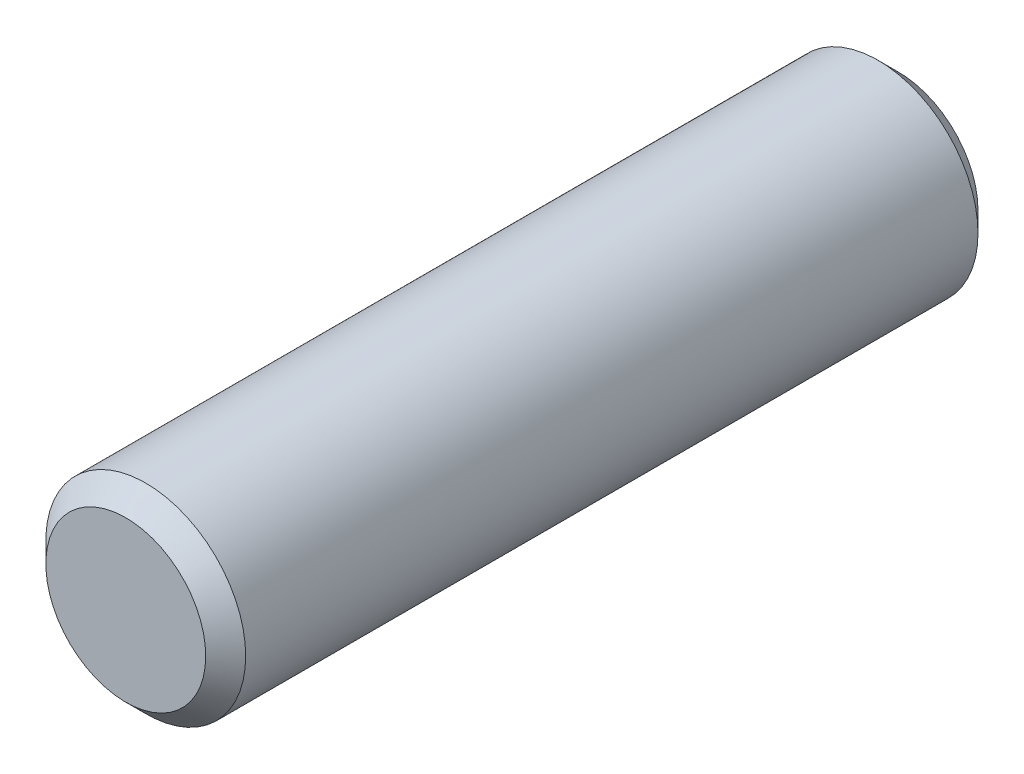
ISO-10303-21;
HEADER;
FILE_DESCRIPTION(('STEP AP214'),'2;1');
FILE_NAME('part.step','',(''),(''),'','','');
FILE_SCHEMA(('AUTOMOTIVE_DESIGN { 1 0 10303 214 1 1 1 1 }'));
ENDSEC;
DATA;
#1=APPLICATION_CONTEXT('core data for automotive mechanical design processes');
#2=APPLICATION_PROTOCOL_DEFINITION('international standard','automotive_design',2000,#1);
#3=PRODUCT_CONTEXT('',#1,'mechanical');
#4=PRODUCT('Part','Part','',(#3));
#5=PRODUCT_RELATED_PRODUCT_CATEGORY('part','',(#4));
#6=PRODUCT_DEFINITION_FORMATION('','',#4);
#7=PRODUCT_DEFINITION_CONTEXT('part definition',#1,'design');
#8=PRODUCT_DEFINITION('design','',#6,#7);
#9=PRODUCT_DEFINITION_SHAPE('','',#8);
#10=(LENGTH_UNIT() NAMED_UNIT(*) SI_UNIT(.MILLI.,.METRE.));
#11=(NAMED_UNIT(*) PLANE_ANGLE_UNIT() SI_UNIT($,.RADIAN.));
#12=(NAMED_UNIT(*) SI_UNIT($,.STERADIAN.) SOLID_ANGLE_UNIT());
#13=UNCERTAINTY_MEASURE_WITH_UNIT(LENGTH_MEASURE(1.E-05),#10,'distance_accuracy_value','');
#14=(GEOMETRIC_REPRESENTATION_CONTEXT(3) GLOBAL_UNCERTAINTY_ASSIGNED_CONTEXT((#13)) GLOBAL_UNIT_ASSIGNED_CONTEXT((#10,
#11,#12)) REPRESENTATION_CONTEXT('',''));
#15=CARTESIAN_POINT('',(0.,0.,0.));
#16=DIRECTION('',(0.,0.,1.));
#17=DIRECTION('',(1.,0.,0.));
#18=AXIS2_PLACEMENT_3D('',#15,#16,#17);
#19=CARTESIAN_POINT('',(0.,0.,30.675));
#20=DIRECTION('',(0.,0.,-1.));
#21=DIRECTION('',(-1.,0.,0.));
#22=AXIS2_PLACEMENT_3D('',#19,#20,#21);
#23=CYLINDRICAL_SURFACE('',#22,7.9375);
#24=CARTESIAN_POINT('',(0.,0.,-29.0875));
#25=DIRECTION('',(0.,0.,1.));
#26=DIRECTION('',(1.,0.,0.));
#27=AXIS2_PLACEMENT_3D('',#24,#25,#26);
#28=CIRCLE('',#27,7.9375);
#29=CARTESIAN_POINT('',(7.9375,0.,-29.0875));
#30=VERTEX_POINT('',#29);
#31=EDGE_CURVE('E51',#30,#30,#28,.T.);
#32=ORIENTED_EDGE('',*,*,#31,.T.);
#33=EDGE_LOOP('',(#32));
#34=FACE_BOUND('',#33,.T.);
#35=CARTESIAN_POINT('',(0.,0.,29.0875));
#36=DIRECTION('',(0.,0.,1.));
#37=DIRECTION('',(1.,0.,0.));
#38=AXIS2_PLACEMENT_3D('',#35,#36,#37);
#39=CIRCLE('',#38,7.9375);
#40=CARTESIAN_POINT('',(7.9375,0.,29.0875));
#41=VERTEX_POINT('',#40);
#42=EDGE_CURVE('E55',#41,#41,#39,.F.);
#43=ORIENTED_EDGE('',*,*,#42,.T.);
#44=EDGE_LOOP('',(#43));
#45=FACE_BOUND('',#44,.T.);
#46=ADVANCED_FACE('F40',(#34,#45),#23,.T.);
#47=CARTESIAN_POINT('',(0.,0.,30.675));
#48=DIRECTION('',(0.,0.,1.));
#49=DIRECTION('',(1.,0.,0.));
#50=AXIS2_PLACEMENT_3D('',#47,#48,#49);
#51=PLANE('',#50);
#52=CARTESIAN_POINT('',(0.,0.,30.675));
#53=DIRECTION('',(0.,0.,1.));
#54=DIRECTION('',(1.,0.,0.));
#55=AXIS2_PLACEMENT_3D('',#52,#53,#54);
#56=CIRCLE('',#55,6.35);
#57=CARTESIAN_POINT('',(6.35,0.,30.675));
#58=VERTEX_POINT('',#57);
#59=EDGE_CURVE('E10',#58,#58,#56,.T.);
#60=ORIENTED_EDGE('',*,*,#59,.T.);
#61=EDGE_LOOP('',(#60));
#62=FACE_BOUND('',#61,.T.);
#63=ADVANCED_FACE('F71',(#62),#51,.T.);
#64=CARTESIAN_POINT('',(0.,0.,-30.675));
#65=DIRECTION('',(0.,0.,1.));
#66=DIRECTION('',(1.,0.,0.));
#67=AXIS2_PLACEMENT_3D('',#64,#65,#66);
#68=PLANE('',#67);
#69=CARTESIAN_POINT('',(0.,0.,-30.675));
#70=DIRECTION('',(0.,0.,1.));
#71=DIRECTION('',(1.,0.,0.));
#72=AXIS2_PLACEMENT_3D('',#69,#70,#71);
#73=CIRCLE('',#72,6.34999999999999);
#74=CARTESIAN_POINT('',(6.34999999999999,0.,-30.675));
#75=VERTEX_POINT('',#74);
#76=EDGE_CURVE('E47',#75,#75,#73,.F.);
#77=ORIENTED_EDGE('',*,*,#76,.T.);
#78=EDGE_LOOP('',(#77));
#79=FACE_BOUND('',#78,.T.);
#80=ADVANCED_FACE('F68',(#79),#68,.F.);
#81=CARTESIAN_POINT('',(0.,0.,-29.0875));
#82=DIRECTION('',(0.,0.,1.));
#83=DIRECTION('',(1.,0.,0.));
#84=AXIS2_PLACEMENT_3D('',#81,#82,#83);
#85=CONICAL_SURFACE('',#84,7.9375,0.785398163397453);
#86=ORIENTED_EDGE('',*,*,#76,.F.);
#87=EDGE_LOOP('',(#86));
#88=FACE_BOUND('',#87,.T.);
#89=ORIENTED_EDGE('',*,*,#31,.F.);
#90=EDGE_LOOP('',(#89));
#91=FACE_BOUND('',#90,.T.);
#92=ADVANCED_FACE('F64',(#88,#91),#85,.T.);
#93=CARTESIAN_POINT('',(0.,0.,30.675));
#94=DIRECTION('',(0.,0.,-1.));
#95=DIRECTION('',(-1.,0.,0.));
#96=AXIS2_PLACEMENT_3D('',#93,#94,#95);
#97=CONICAL_SURFACE('',#96,6.35,0.785398163397444);
#98=ORIENTED_EDGE('',*,*,#42,.F.);
#99=EDGE_LOOP('',(#98));
#100=FACE_BOUND('',#99,.T.);
#101=ORIENTED_EDGE('',*,*,#59,.F.);
#102=EDGE_LOOP('',(#101));
#103=FACE_BOUND('',#102,.T.);
#104=ADVANCED_FACE('F42',(#100,#103),#97,.T.);
#105=CLOSED_SHELL('',(#46,#63,#80,#92,#104));
#106=MANIFOLD_SOLID_BREP('B2',#105);
#107=ADVANCED_BREP_SHAPE_REPRESENTATION('',(#18,#106),#14);
#108=SHAPE_DEFINITION_REPRESENTATION(#9,#107);
ENDSEC;
END-ISO-10303-21;
